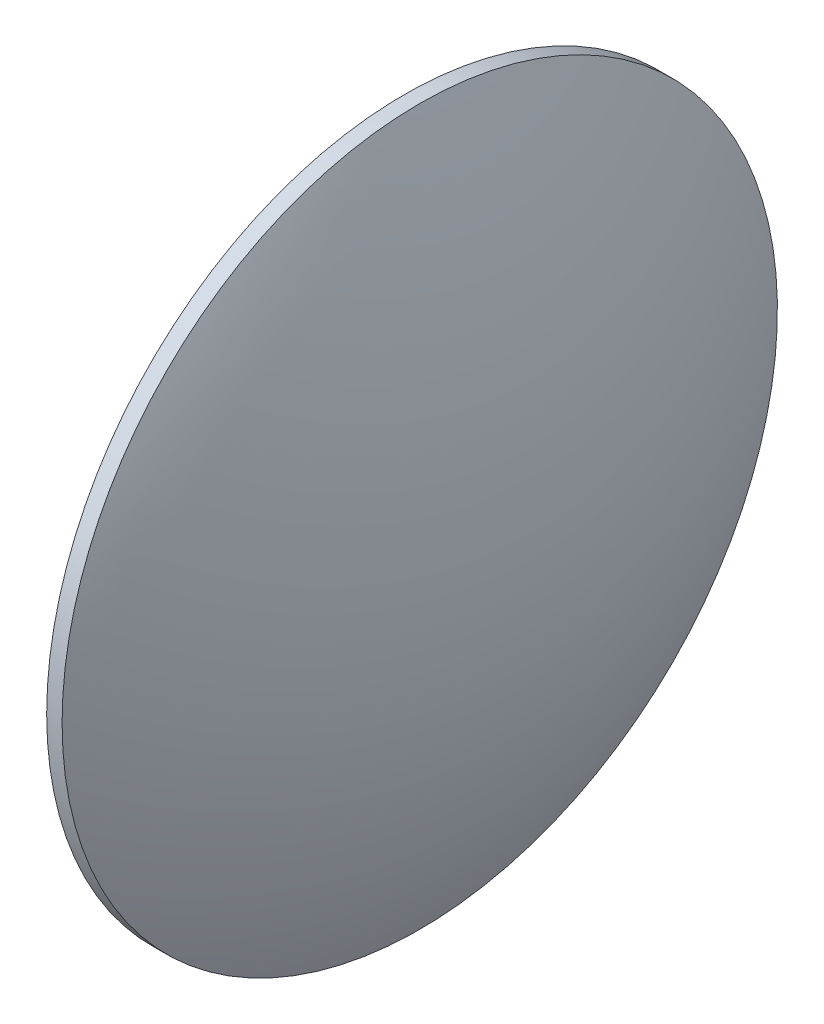
ISO-10303-21;
HEADER;
FILE_DESCRIPTION(('STEP AP214'),'2;1');
FILE_NAME('part.step','',(''),(''),'','','');
FILE_SCHEMA(('AUTOMOTIVE_DESIGN { 1 0 10303 214 1 1 1 1 }'));
ENDSEC;
DATA;
#1=APPLICATION_CONTEXT('core data for automotive mechanical design processes');
#2=APPLICATION_PROTOCOL_DEFINITION('international standard','automotive_design',2000,#1);
#3=PRODUCT_CONTEXT('',#1,'mechanical');
#4=PRODUCT('Part','Part','',(#3));
#5=PRODUCT_RELATED_PRODUCT_CATEGORY('part','',(#4));
#6=PRODUCT_DEFINITION_FORMATION('','',#4);
#7=PRODUCT_DEFINITION_CONTEXT('part definition',#1,'design');
#8=PRODUCT_DEFINITION('design','',#6,#7);
#9=PRODUCT_DEFINITION_SHAPE('','',#8);
#10=(LENGTH_UNIT() NAMED_UNIT(*) SI_UNIT(.MILLI.,.METRE.));
#11=(NAMED_UNIT(*) PLANE_ANGLE_UNIT() SI_UNIT($,.RADIAN.));
#12=(NAMED_UNIT(*) SI_UNIT($,.STERADIAN.) SOLID_ANGLE_UNIT());
#13=UNCERTAINTY_MEASURE_WITH_UNIT(LENGTH_MEASURE(1.E-05),#10,'distance_accuracy_value','');
#14=(GEOMETRIC_REPRESENTATION_CONTEXT(3) GLOBAL_UNCERTAINTY_ASSIGNED_CONTEXT((#13)) GLOBAL_UNIT_ASSIGNED_CONTEXT((#10,
#11,#12)) REPRESENTATION_CONTEXT('',''));
#15=CARTESIAN_POINT('',(0.,0.,0.));
#16=DIRECTION('',(0.,0.,1.));
#17=DIRECTION('',(1.,0.,0.));
#18=AXIS2_PLACEMENT_3D('',#15,#16,#17);
#19=CARTESIAN_POINT('',(502.712043017193,55.9079758428992,0.));
#20=DIRECTION('',(-1.,0.,0.));
#21=DIRECTION('',(0.,1.,0.));
#22=AXIS2_PLACEMENT_3D('',#19,#20,#21);
#23=SPHERICAL_SURFACE('',#22,51.9071052631579);
#24=CARTESIAN_POINT('',(549.489148280351,55.9079758428992,0.));
#25=DIRECTION('',(-1.,0.,0.));
#26=DIRECTION('',(0.,0.,1.));
#27=AXIS2_PLACEMENT_3D('',#24,#25,#26);
#28=CIRCLE('',#27,22.5);
#29=CARTESIAN_POINT('',(549.489148280351,55.9079758428992,22.5));
#30=VERTEX_POINT('',#29);
#31=EDGE_CURVE('E10',#30,#30,#28,.T.);
#32=ORIENTED_EDGE('',*,*,#31,.F.);
#33=EDGE_LOOP('',(#32));
#34=FACE_BOUND('',#33,.T.);
#35=ADVANCED_FACE('F35',(#34),#23,.T.);
#36=CARTESIAN_POINT('',(543.870940653029,55.9079758428992,0.));
#37=DIRECTION('',(-1.,0.,0.));
#38=DIRECTION('',(0.,0.,1.));
#39=AXIS2_PLACEMENT_3D('',#36,#37,#38);
#40=CYLINDRICAL_SURFACE('',#39,22.5);
#41=CARTESIAN_POINT('',(548.519148280351,55.9079758428992,0.));
#42=DIRECTION('',(-1.,0.,0.));
#43=DIRECTION('',(0.,0.,1.));
#44=AXIS2_PLACEMENT_3D('',#41,#42,#43);
#45=CIRCLE('',#44,22.5);
#46=CARTESIAN_POINT('',(548.519148280351,55.9079758428992,22.5));
#47=VERTEX_POINT('',#46);
#48=EDGE_CURVE('E41',#47,#47,#45,.T.);
#49=ORIENTED_EDGE('',*,*,#48,.F.);
#50=EDGE_LOOP('',(#49));
#51=FACE_BOUND('',#50,.T.);
#52=ORIENTED_EDGE('',*,*,#31,.T.);
#53=EDGE_LOOP('',(#52));
#54=FACE_BOUND('',#53,.T.);
#55=ADVANCED_FACE('F49',(#51,#54),#40,.T.);
#56=CARTESIAN_POINT('',(548.519148280351,55.9079758428992,0.));
#57=DIRECTION('',(1.,0.,0.));
#58=DIRECTION('',(0.,0.,-1.));
#59=AXIS2_PLACEMENT_3D('',#56,#57,#58);
#60=PLANE('',#59);
#61=ORIENTED_EDGE('',*,*,#48,.T.);
#62=EDGE_LOOP('',(#61));
#63=FACE_BOUND('',#62,.T.);
#64=ADVANCED_FACE('F47',(#63),#60,.F.);
#65=CLOSED_SHELL('',(#35,#55,#64));
#66=MANIFOLD_SOLID_BREP('B2',#65);
#67=ADVANCED_BREP_SHAPE_REPRESENTATION('',(#18,#66),#14);
#68=SHAPE_DEFINITION_REPRESENTATION(#9,#67);
ENDSEC;
END-ISO-10303-21;
